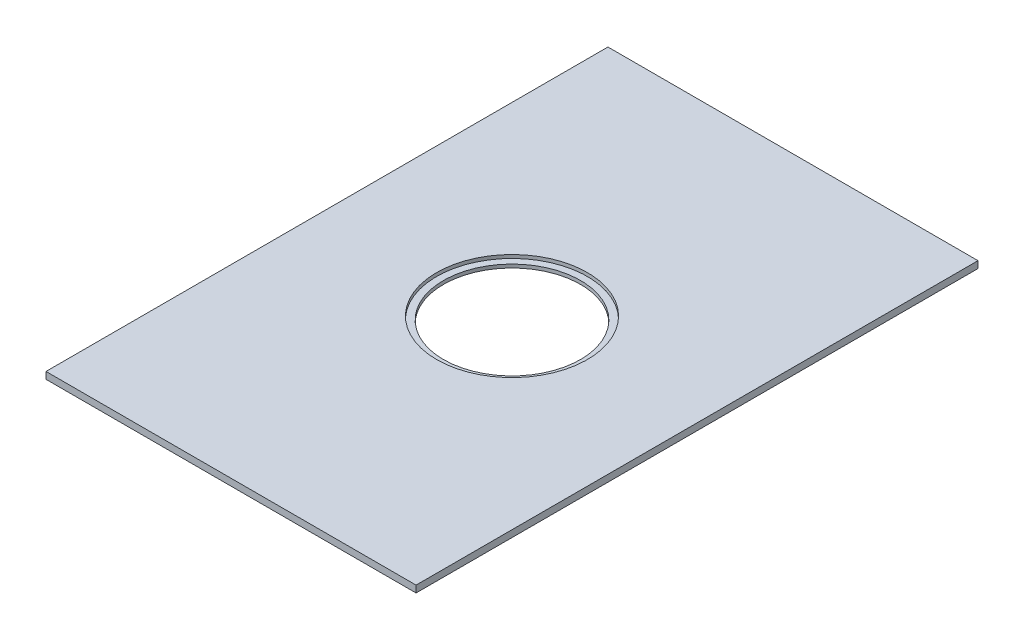
ISO-10303-21;
HEADER;
FILE_DESCRIPTION(('STEP AP214'),'2;1');
FILE_NAME('part.step','',(''),(''),'','','');
FILE_SCHEMA(('AUTOMOTIVE_DESIGN { 1 0 10303 214 1 1 1 1 }'));
ENDSEC;
DATA;
#1=APPLICATION_CONTEXT('core data for automotive mechanical design processes');
#2=APPLICATION_PROTOCOL_DEFINITION('international standard','automotive_design',2000,#1);
#3=PRODUCT_CONTEXT('',#1,'mechanical');
#4=PRODUCT('Part','Part','',(#3));
#5=PRODUCT_RELATED_PRODUCT_CATEGORY('part','',(#4));
#6=PRODUCT_DEFINITION_FORMATION('','',#4);
#7=PRODUCT_DEFINITION_CONTEXT('part definition',#1,'design');
#8=PRODUCT_DEFINITION('design','',#6,#7);
#9=PRODUCT_DEFINITION_SHAPE('','',#8);
#10=(LENGTH_UNIT() NAMED_UNIT(*) SI_UNIT(.MILLI.,.METRE.));
#11=(NAMED_UNIT(*) PLANE_ANGLE_UNIT() SI_UNIT($,.RADIAN.));
#12=(NAMED_UNIT(*) SI_UNIT($,.STERADIAN.) SOLID_ANGLE_UNIT());
#13=UNCERTAINTY_MEASURE_WITH_UNIT(LENGTH_MEASURE(1.E-05),#10,'distance_accuracy_value','');
#14=(GEOMETRIC_REPRESENTATION_CONTEXT(3) GLOBAL_UNCERTAINTY_ASSIGNED_CONTEXT((#13)) GLOBAL_UNIT_ASSIGNED_CONTEXT((#10,
#11,#12)) REPRESENTATION_CONTEXT('',''));
#15=CARTESIAN_POINT('',(0.,0.,0.));
#16=DIRECTION('',(0.,0.,1.));
#17=DIRECTION('',(1.,0.,0.));
#18=AXIS2_PLACEMENT_3D('',#15,#16,#17);
#19=CARTESIAN_POINT('',(54.,-2.,82.));
#20=DIRECTION('',(0.,0.,1.));
#21=DIRECTION('',(1.,0.,0.));
#22=AXIS2_PLACEMENT_3D('',#19,#20,#21);
#23=PLANE('',#22);
#24=DIRECTION('',(1.,0.,0.));
#25=VECTOR('',#24,1.);
#26=CARTESIAN_POINT('',(54.,0.,82.));
#27=LINE('',#26,#25);
#28=CARTESIAN_POINT('',(-54.,0.,82.));
#29=VERTEX_POINT('',#28);
#30=CARTESIAN_POINT('',(54.,0.,82.));
#31=VERTEX_POINT('',#30);
#32=EDGE_CURVE('E110',#29,#31,#27,.T.);
#33=ORIENTED_EDGE('',*,*,#32,.F.);
#34=DIRECTION('',(0.,1.,0.));
#35=VECTOR('',#34,1.);
#36=CARTESIAN_POINT('',(-54.,-2.,82.));
#37=LINE('',#36,#35);
#38=CARTESIAN_POINT('',(-54.,-2.,82.));
#39=VERTEX_POINT('',#38);
#40=EDGE_CURVE('E11',#39,#29,#37,.T.);
#41=ORIENTED_EDGE('',*,*,#40,.F.);
#42=DIRECTION('',(1.,0.,0.));
#43=VECTOR('',#42,1.);
#44=CARTESIAN_POINT('',(54.,-2.,82.));
#45=LINE('',#44,#43);
#46=CARTESIAN_POINT('',(54.,-2.,82.));
#47=VERTEX_POINT('',#46);
#48=EDGE_CURVE('E101',#39,#47,#45,.T.);
#49=ORIENTED_EDGE('',*,*,#48,.T.);
#50=DIRECTION('',(0.,1.,0.));
#51=VECTOR('',#50,1.);
#52=CARTESIAN_POINT('',(54.,-2.,82.));
#53=LINE('',#52,#51);
#54=EDGE_CURVE('E42',#47,#31,#53,.T.);
#55=ORIENTED_EDGE('',*,*,#54,.T.);
#56=EDGE_LOOP('',(#33,#41,#49,#55));
#57=FACE_BOUND('',#56,.T.);
#58=ADVANCED_FACE('F39',(#57),#23,.T.);
#59=CARTESIAN_POINT('',(-54.,-2.,82.));
#60=DIRECTION('',(-1.,0.,0.));
#61=DIRECTION('',(0.,0.,1.));
#62=AXIS2_PLACEMENT_3D('',#59,#60,#61);
#63=PLANE('',#62);
#64=DIRECTION('',(0.,0.,1.));
#65=VECTOR('',#64,1.);
#66=CARTESIAN_POINT('',(-54.,0.,82.));
#67=LINE('',#66,#65);
#68=CARTESIAN_POINT('',(-54.,0.,-82.));
#69=VERTEX_POINT('',#68);
#70=EDGE_CURVE('E104',#69,#29,#67,.T.);
#71=ORIENTED_EDGE('',*,*,#70,.F.);
#72=DIRECTION('',(0.,1.,0.));
#73=VECTOR('',#72,1.);
#74=CARTESIAN_POINT('',(-54.,-2.,-82.));
#75=LINE('',#74,#73);
#76=CARTESIAN_POINT('',(-54.,-2.,-82.));
#77=VERTEX_POINT('',#76);
#78=EDGE_CURVE('E49',#77,#69,#75,.T.);
#79=ORIENTED_EDGE('',*,*,#78,.F.);
#80=DIRECTION('',(0.,0.,1.));
#81=VECTOR('',#80,1.);
#82=CARTESIAN_POINT('',(-54.,-2.,82.));
#83=LINE('',#82,#81);
#84=EDGE_CURVE('E96',#77,#39,#83,.T.);
#85=ORIENTED_EDGE('',*,*,#84,.T.);
#86=ORIENTED_EDGE('',*,*,#40,.T.);
#87=EDGE_LOOP('',(#71,#79,#85,#86));
#88=FACE_BOUND('',#87,.T.);
#89=ADVANCED_FACE('F127',(#88),#63,.T.);
#90=CARTESIAN_POINT('',(-54.,-2.,-82.));
#91=DIRECTION('',(0.,0.,-1.));
#92=DIRECTION('',(-1.,0.,0.));
#93=AXIS2_PLACEMENT_3D('',#90,#91,#92);
#94=PLANE('',#93);
#95=DIRECTION('',(-1.,0.,0.));
#96=VECTOR('',#95,1.);
#97=CARTESIAN_POINT('',(-54.,0.,-82.));
#98=LINE('',#97,#96);
#99=CARTESIAN_POINT('',(54.,0.,-82.));
#100=VERTEX_POINT('',#99);
#101=EDGE_CURVE('E90',#100,#69,#98,.T.);
#102=ORIENTED_EDGE('',*,*,#101,.F.);
#103=DIRECTION('',(0.,1.,0.));
#104=VECTOR('',#103,1.);
#105=CARTESIAN_POINT('',(54.,-2.,-82.));
#106=LINE('',#105,#104);
#107=CARTESIAN_POINT('',(54.,-2.,-82.));
#108=VERTEX_POINT('',#107);
#109=EDGE_CURVE('E85',#108,#100,#106,.T.);
#110=ORIENTED_EDGE('',*,*,#109,.F.);
#111=DIRECTION('',(-1.,0.,0.));
#112=VECTOR('',#111,1.);
#113=CARTESIAN_POINT('',(-54.,-2.,-82.));
#114=LINE('',#113,#112);
#115=EDGE_CURVE('E88',#108,#77,#114,.T.);
#116=ORIENTED_EDGE('',*,*,#115,.T.);
#117=ORIENTED_EDGE('',*,*,#78,.T.);
#118=EDGE_LOOP('',(#102,#110,#116,#117));
#119=FACE_BOUND('',#118,.T.);
#120=ADVANCED_FACE('F87',(#119),#94,.T.);
#121=CARTESIAN_POINT('',(54.,-2.,-82.));
#122=DIRECTION('',(1.,0.,0.));
#123=DIRECTION('',(0.,0.,-1.));
#124=AXIS2_PLACEMENT_3D('',#121,#122,#123);
#125=PLANE('',#124);
#126=DIRECTION('',(0.,0.,-1.));
#127=VECTOR('',#126,1.);
#128=CARTESIAN_POINT('',(54.,0.,-82.));
#129=LINE('',#128,#127);
#130=EDGE_CURVE('E114',#31,#100,#129,.T.);
#131=ORIENTED_EDGE('',*,*,#130,.F.);
#132=ORIENTED_EDGE('',*,*,#54,.F.);
#133=DIRECTION('',(0.,0.,-1.));
#134=VECTOR('',#133,1.);
#135=CARTESIAN_POINT('',(54.,-2.,-82.));
#136=LINE('',#135,#134);
#137=EDGE_CURVE('E95',#47,#108,#136,.T.);
#138=ORIENTED_EDGE('',*,*,#137,.T.);
#139=ORIENTED_EDGE('',*,*,#109,.T.);
#140=EDGE_LOOP('',(#131,#132,#138,#139));
#141=FACE_BOUND('',#140,.T.);
#142=ADVANCED_FACE('F99',(#141),#125,.T.);
#143=CARTESIAN_POINT('',(0.,-2.,0.));
#144=DIRECTION('',(0.,-1.,0.));
#145=DIRECTION('',(0.,0.,-1.));
#146=AXIS2_PLACEMENT_3D('',#143,#144,#145);
#147=PLANE('',#146);
#148=CARTESIAN_POINT('',(0.,-2.,0.));
#149=DIRECTION('',(0.,1.,0.));
#150=DIRECTION('',(0.,0.,1.));
#151=AXIS2_PLACEMENT_3D('',#148,#149,#150);
#152=CIRCLE('',#151,20.);
#153=CARTESIAN_POINT('',(0.,-2.,20.));
#154=VERTEX_POINT('',#153);
#155=EDGE_CURVE('E163',#154,#154,#152,.T.);
#156=ORIENTED_EDGE('',*,*,#155,.T.);
#157=EDGE_LOOP('',(#156));
#158=FACE_BOUND('',#157,.T.);
#159=ORIENTED_EDGE('',*,*,#48,.F.);
#160=ORIENTED_EDGE('',*,*,#84,.F.);
#161=ORIENTED_EDGE('',*,*,#115,.F.);
#162=ORIENTED_EDGE('',*,*,#137,.F.);
#163=EDGE_LOOP('',(#159,#160,#161,#162));
#164=FACE_BOUND('',#163,.T.);
#165=ADVANCED_FACE('F94',(#158,#164),#147,.T.);
#166=CARTESIAN_POINT('',(0.,0.,0.));
#167=DIRECTION('',(0.,-1.,0.));
#168=DIRECTION('',(0.,0.,-1.));
#169=AXIS2_PLACEMENT_3D('',#166,#167,#168);
#170=PLANE('',#169);
#171=CARTESIAN_POINT('',(0.,0.,0.));
#172=DIRECTION('',(0.,1.,0.));
#173=DIRECTION('',(0.,0.,1.));
#174=AXIS2_PLACEMENT_3D('',#171,#172,#173);
#175=CIRCLE('',#174,22.);
#176=CARTESIAN_POINT('',(0.,0.,22.));
#177=VERTEX_POINT('',#176);
#178=EDGE_CURVE('E170',#177,#177,#175,.T.);
#179=ORIENTED_EDGE('',*,*,#178,.F.);
#180=EDGE_LOOP('',(#179));
#181=FACE_BOUND('',#180,.T.);
#182=ORIENTED_EDGE('',*,*,#32,.T.);
#183=ORIENTED_EDGE('',*,*,#130,.T.);
#184=ORIENTED_EDGE('',*,*,#101,.T.);
#185=ORIENTED_EDGE('',*,*,#70,.T.);
#186=EDGE_LOOP('',(#182,#183,#184,#185));
#187=FACE_BOUND('',#186,.T.);
#188=ADVANCED_FACE('F126',(#181,#187),#170,.F.);
#189=CARTESIAN_POINT('',(0.,-1.,0.));
#190=DIRECTION('',(0.,1.,0.));
#191=DIRECTION('',(0.,0.,1.));
#192=AXIS2_PLACEMENT_3D('',#189,#190,#191);
#193=CYLINDRICAL_SURFACE('',#192,22.);
#194=CARTESIAN_POINT('',(0.,-1.,0.));
#195=DIRECTION('',(0.,1.,0.));
#196=DIRECTION('',(0.,0.,1.));
#197=AXIS2_PLACEMENT_3D('',#194,#195,#196);
#198=CIRCLE('',#197,22.);
#199=CARTESIAN_POINT('',(0.,-1.,22.));
#200=VERTEX_POINT('',#199);
#201=EDGE_CURVE('E115',#200,#200,#198,.T.);
#202=ORIENTED_EDGE('',*,*,#201,.F.);
#203=EDGE_LOOP('',(#202));
#204=FACE_BOUND('',#203,.T.);
#205=ORIENTED_EDGE('',*,*,#178,.T.);
#206=EDGE_LOOP('',(#205));
#207=FACE_BOUND('',#206,.T.);
#208=ADVANCED_FACE('F145',(#204,#207),#193,.F.);
#209=CARTESIAN_POINT('',(0.,-1.,0.));
#210=DIRECTION('',(0.,1.,0.));
#211=DIRECTION('',(0.,0.,1.));
#212=AXIS2_PLACEMENT_3D('',#209,#210,#211);
#213=PLANE('',#212);
#214=CARTESIAN_POINT('',(0.,-1.,0.));
#215=DIRECTION('',(0.,1.,0.));
#216=DIRECTION('',(0.,0.,1.));
#217=AXIS2_PLACEMENT_3D('',#214,#215,#216);
#218=CIRCLE('',#217,20.);
#219=CARTESIAN_POINT('',(0.,-1.,20.));
#220=VERTEX_POINT('',#219);
#221=EDGE_CURVE('E166',#220,#220,#218,.T.);
#222=ORIENTED_EDGE('',*,*,#221,.F.);
#223=EDGE_LOOP('',(#222));
#224=FACE_BOUND('',#223,.T.);
#225=ORIENTED_EDGE('',*,*,#201,.T.);
#226=EDGE_LOOP('',(#225));
#227=FACE_BOUND('',#226,.T.);
#228=ADVANCED_FACE('F151',(#224,#227),#213,.T.);
#229=CARTESIAN_POINT('',(0.,-2.,0.));
#230=DIRECTION('',(0.,1.,0.));
#231=DIRECTION('',(0.,0.,1.));
#232=AXIS2_PLACEMENT_3D('',#229,#230,#231);
#233=CYLINDRICAL_SURFACE('',#232,20.);
#234=ORIENTED_EDGE('',*,*,#155,.F.);
#235=EDGE_LOOP('',(#234));
#236=FACE_BOUND('',#235,.T.);
#237=ORIENTED_EDGE('',*,*,#221,.T.);
#238=EDGE_LOOP('',(#237));
#239=FACE_BOUND('',#238,.T.);
#240=ADVANCED_FACE('F155',(#236,#239),#233,.F.);
#241=CLOSED_SHELL('',(#58,#89,#120,#142,#165,#188,#208,#228,#240));
#242=MANIFOLD_SOLID_BREP('B2',#241);
#243=ADVANCED_BREP_SHAPE_REPRESENTATION('',(#18,#242),#14);
#244=SHAPE_DEFINITION_REPRESENTATION(#9,#243);
ENDSEC;
END-ISO-10303-21;
